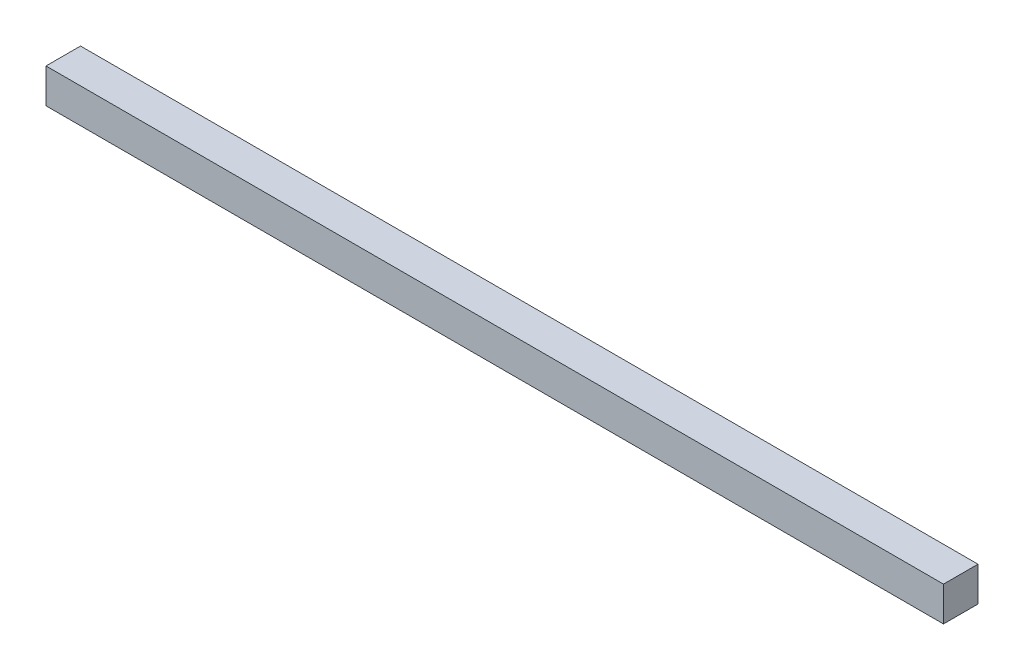
ISO-10303-21;
HEADER;
FILE_DESCRIPTION(('STEP AP214'),'2;1');
FILE_NAME('part.step','',(''),(''),'','','');
FILE_SCHEMA(('AUTOMOTIVE_DESIGN { 1 0 10303 214 1 1 1 1 }'));
ENDSEC;
DATA;
#1=APPLICATION_CONTEXT('core data for automotive mechanical design processes');
#2=APPLICATION_PROTOCOL_DEFINITION('international standard','automotive_design',2000,#1);
#3=PRODUCT_CONTEXT('',#1,'mechanical');
#4=PRODUCT('Part','Part','',(#3));
#5=PRODUCT_RELATED_PRODUCT_CATEGORY('part','',(#4));
#6=PRODUCT_DEFINITION_FORMATION('','',#4);
#7=PRODUCT_DEFINITION_CONTEXT('part definition',#1,'design');
#8=PRODUCT_DEFINITION('design','',#6,#7);
#9=PRODUCT_DEFINITION_SHAPE('','',#8);
#10=(LENGTH_UNIT() NAMED_UNIT(*) SI_UNIT(.MILLI.,.METRE.));
#11=(NAMED_UNIT(*) PLANE_ANGLE_UNIT() SI_UNIT($,.RADIAN.));
#12=(NAMED_UNIT(*) SI_UNIT($,.STERADIAN.) SOLID_ANGLE_UNIT());
#13=UNCERTAINTY_MEASURE_WITH_UNIT(LENGTH_MEASURE(1.E-05),#10,'distance_accuracy_value','');
#14=(GEOMETRIC_REPRESENTATION_CONTEXT(3) GLOBAL_UNCERTAINTY_ASSIGNED_CONTEXT((#13)) GLOBAL_UNIT_ASSIGNED_CONTEXT((#10,
#11,#12)) REPRESENTATION_CONTEXT('',''));
#15=CARTESIAN_POINT('',(0.,0.,0.));
#16=DIRECTION('',(0.,0.,1.));
#17=DIRECTION('',(1.,0.,0.));
#18=AXIS2_PLACEMENT_3D('',#15,#16,#17);
#19=CARTESIAN_POINT('',(-130.,10.,-4.99999999999999));
#20=DIRECTION('',(1.,0.,0.));
#21=DIRECTION('',(0.,0.,-1.));
#22=AXIS2_PLACEMENT_3D('',#19,#20,#21);
#23=PLANE('',#22);
#24=DIRECTION('',(0.,0.,1.));
#25=VECTOR('',#24,1.);
#26=CARTESIAN_POINT('',(-130.,0.,-4.99999999999999));
#27=LINE('',#26,#25);
#28=CARTESIAN_POINT('',(-130.,0.,-4.99999999999999));
#29=VERTEX_POINT('',#28);
#30=CARTESIAN_POINT('',(-130.,0.,5.00000000000001));
#31=VERTEX_POINT('',#30);
#32=EDGE_CURVE('E96',#29,#31,#27,.T.);
#33=ORIENTED_EDGE('',*,*,#32,.T.);
#34=DIRECTION('',(0.,-1.,0.));
#35=VECTOR('',#34,1.);
#36=CARTESIAN_POINT('',(-130.,10.,5.00000000000001));
#37=LINE('',#36,#35);
#38=CARTESIAN_POINT('',(-130.,10.,5.00000000000001));
#39=VERTEX_POINT('',#38);
#40=EDGE_CURVE('E11',#39,#31,#37,.T.);
#41=ORIENTED_EDGE('',*,*,#40,.F.);
#42=DIRECTION('',(0.,0.,1.));
#43=VECTOR('',#42,1.);
#44=CARTESIAN_POINT('',(-130.,10.,-4.99999999999999));
#45=LINE('',#44,#43);
#46=CARTESIAN_POINT('',(-130.,10.,-4.99999999999999));
#47=VERTEX_POINT('',#46);
#48=EDGE_CURVE('E84',#47,#39,#45,.T.);
#49=ORIENTED_EDGE('',*,*,#48,.F.);
#50=DIRECTION('',(0.,-1.,0.));
#51=VECTOR('',#50,1.);
#52=CARTESIAN_POINT('',(-130.,10.,-4.99999999999999));
#53=LINE('',#52,#51);
#54=EDGE_CURVE('E92',#47,#29,#53,.T.);
#55=ORIENTED_EDGE('',*,*,#54,.T.);
#56=EDGE_LOOP('',(#33,#41,#49,#55));
#57=FACE_BOUND('',#56,.T.);
#58=ADVANCED_FACE('F33',(#57),#23,.F.);
#59=CARTESIAN_POINT('',(-130.,10.,5.00000000000001));
#60=DIRECTION('',(0.,0.,-1.));
#61=DIRECTION('',(-1.,0.,0.));
#62=AXIS2_PLACEMENT_3D('',#59,#60,#61);
#63=PLANE('',#62);
#64=DIRECTION('',(1.,0.,0.));
#65=VECTOR('',#64,1.);
#66=CARTESIAN_POINT('',(-130.,0.,5.00000000000001));
#67=LINE('',#66,#65);
#68=CARTESIAN_POINT('',(130.,0.,5.00000000000001));
#69=VERTEX_POINT('',#68);
#70=EDGE_CURVE('E88',#31,#69,#67,.T.);
#71=ORIENTED_EDGE('',*,*,#70,.T.);
#72=DIRECTION('',(0.,-1.,0.));
#73=VECTOR('',#72,1.);
#74=CARTESIAN_POINT('',(130.,10.,5.00000000000001));
#75=LINE('',#74,#73);
#76=CARTESIAN_POINT('',(130.,10.,5.00000000000001));
#77=VERTEX_POINT('',#76);
#78=EDGE_CURVE('E41',#77,#69,#75,.T.);
#79=ORIENTED_EDGE('',*,*,#78,.F.);
#80=DIRECTION('',(1.,0.,0.));
#81=VECTOR('',#80,1.);
#82=CARTESIAN_POINT('',(-130.,10.,5.00000000000001));
#83=LINE('',#82,#81);
#84=EDGE_CURVE('E79',#39,#77,#83,.T.);
#85=ORIENTED_EDGE('',*,*,#84,.F.);
#86=ORIENTED_EDGE('',*,*,#40,.T.);
#87=EDGE_LOOP('',(#71,#79,#85,#86));
#88=FACE_BOUND('',#87,.T.);
#89=ADVANCED_FACE('F87',(#88),#63,.F.);
#90=CARTESIAN_POINT('',(130.,10.,-4.99999999999999));
#91=DIRECTION('',(-1.,0.,0.));
#92=DIRECTION('',(0.,0.,1.));
#93=AXIS2_PLACEMENT_3D('',#90,#91,#92);
#94=PLANE('',#93);
#95=DIRECTION('',(0.,0.,-1.));
#96=VECTOR('',#95,1.);
#97=CARTESIAN_POINT('',(130.,0.,-4.99999999999999));
#98=LINE('',#97,#96);
#99=CARTESIAN_POINT('',(130.,0.,-4.99999999999999));
#100=VERTEX_POINT('',#99);
#101=EDGE_CURVE('E66',#69,#100,#98,.T.);
#102=ORIENTED_EDGE('',*,*,#101,.T.);
#103=DIRECTION('',(0.,-1.,0.));
#104=VECTOR('',#103,1.);
#105=CARTESIAN_POINT('',(130.,10.,-4.99999999999999));
#106=LINE('',#105,#104);
#107=CARTESIAN_POINT('',(130.,10.,-4.99999999999999));
#108=VERTEX_POINT('',#107);
#109=EDGE_CURVE('E89',#108,#100,#106,.T.);
#110=ORIENTED_EDGE('',*,*,#109,.F.);
#111=DIRECTION('',(0.,0.,-1.));
#112=VECTOR('',#111,1.);
#113=CARTESIAN_POINT('',(130.,10.,-4.99999999999999));
#114=LINE('',#113,#112);
#115=EDGE_CURVE('E82',#77,#108,#114,.T.);
#116=ORIENTED_EDGE('',*,*,#115,.F.);
#117=ORIENTED_EDGE('',*,*,#78,.T.);
#118=EDGE_LOOP('',(#102,#110,#116,#117));
#119=FACE_BOUND('',#118,.T.);
#120=ADVANCED_FACE('F90',(#119),#94,.F.);
#121=CARTESIAN_POINT('',(-130.,10.,-4.99999999999999));
#122=DIRECTION('',(0.,0.,1.));
#123=DIRECTION('',(1.,0.,0.));
#124=AXIS2_PLACEMENT_3D('',#121,#122,#123);
#125=PLANE('',#124);
#126=DIRECTION('',(-1.,0.,0.));
#127=VECTOR('',#126,1.);
#128=CARTESIAN_POINT('',(-130.,0.,-4.99999999999999));
#129=LINE('',#128,#127);
#130=EDGE_CURVE('E72',#100,#29,#129,.T.);
#131=ORIENTED_EDGE('',*,*,#130,.T.);
#132=ORIENTED_EDGE('',*,*,#54,.F.);
#133=DIRECTION('',(-1.,0.,0.));
#134=VECTOR('',#133,1.);
#135=CARTESIAN_POINT('',(-130.,10.,-4.99999999999999));
#136=LINE('',#135,#134);
#137=EDGE_CURVE('E49',#108,#47,#136,.T.);
#138=ORIENTED_EDGE('',*,*,#137,.F.);
#139=ORIENTED_EDGE('',*,*,#109,.T.);
#140=EDGE_LOOP('',(#131,#132,#138,#139));
#141=FACE_BOUND('',#140,.T.);
#142=ADVANCED_FACE('F103',(#141),#125,.F.);
#143=CARTESIAN_POINT('',(0.,10.,0.));
#144=DIRECTION('',(0.,1.,0.));
#145=DIRECTION('',(0.,0.,1.));
#146=AXIS2_PLACEMENT_3D('',#143,#144,#145);
#147=PLANE('',#146);
#148=ORIENTED_EDGE('',*,*,#48,.T.);
#149=ORIENTED_EDGE('',*,*,#84,.T.);
#150=ORIENTED_EDGE('',*,*,#115,.T.);
#151=ORIENTED_EDGE('',*,*,#137,.T.);
#152=EDGE_LOOP('',(#148,#149,#150,#151));
#153=FACE_BOUND('',#152,.T.);
#154=ADVANCED_FACE('F80',(#153),#147,.T.);
#155=CARTESIAN_POINT('',(0.,0.,0.));
#156=DIRECTION('',(0.,1.,0.));
#157=DIRECTION('',(0.,0.,1.));
#158=AXIS2_PLACEMENT_3D('',#155,#156,#157);
#159=PLANE('',#158);
#160=ORIENTED_EDGE('',*,*,#32,.F.);
#161=ORIENTED_EDGE('',*,*,#130,.F.);
#162=ORIENTED_EDGE('',*,*,#101,.F.);
#163=ORIENTED_EDGE('',*,*,#70,.F.);
#164=EDGE_LOOP('',(#160,#161,#162,#163));
#165=FACE_BOUND('',#164,.T.);
#166=ADVANCED_FACE('F106',(#165),#159,.F.);
#167=CLOSED_SHELL('',(#58,#89,#120,#142,#154,#166));
#168=MANIFOLD_SOLID_BREP('B2',#167);
#169=ADVANCED_BREP_SHAPE_REPRESENTATION('',(#18,#168),#14);
#170=SHAPE_DEFINITION_REPRESENTATION(#9,#169);
ENDSEC;
END-ISO-10303-21;
